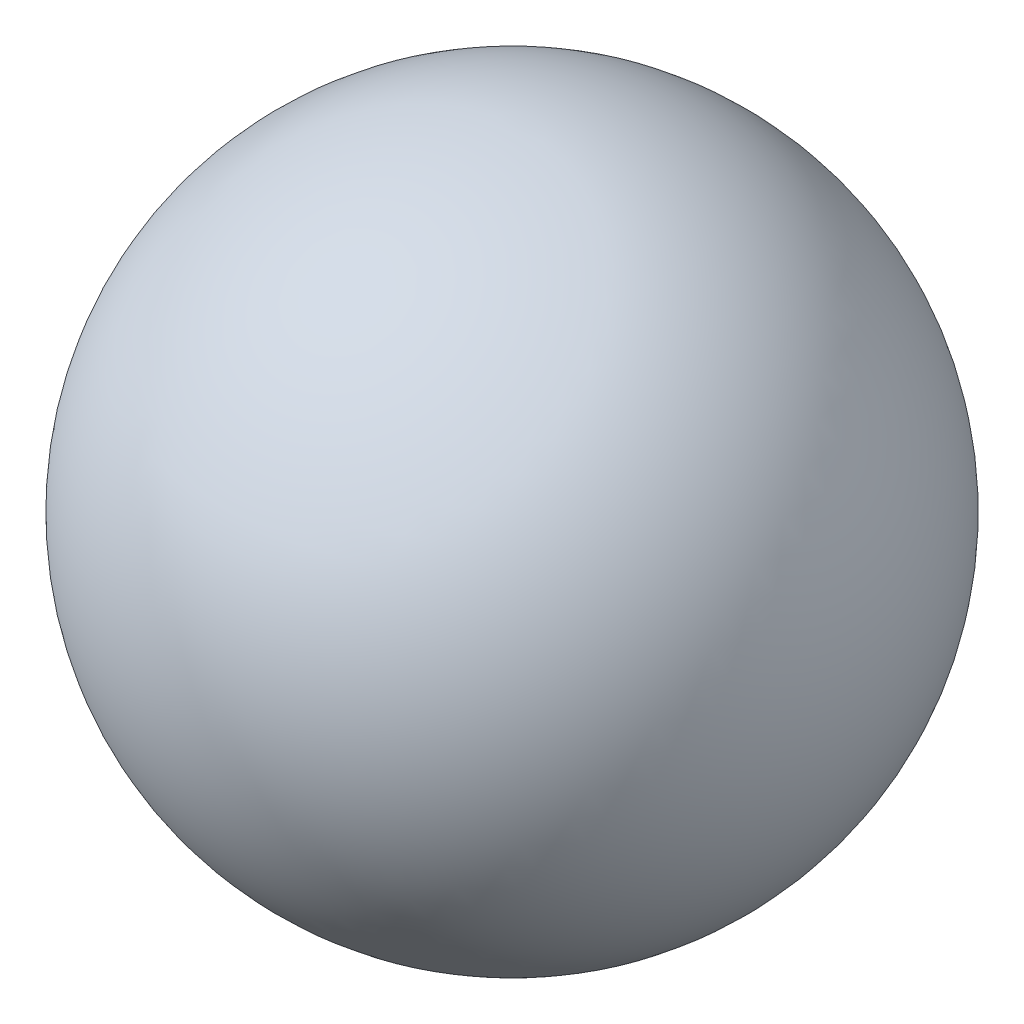
ISO-10303-21;
HEADER;
FILE_DESCRIPTION(('STEP AP214'),'2;1');
FILE_NAME('part.step','',(''),(''),'','','');
FILE_SCHEMA(('AUTOMOTIVE_DESIGN { 1 0 10303 214 1 1 1 1 }'));
ENDSEC;
DATA;
#1=APPLICATION_CONTEXT('core data for automotive mechanical design processes');
#2=APPLICATION_PROTOCOL_DEFINITION('international standard','automotive_design',2000,#1);
#3=PRODUCT_CONTEXT('',#1,'mechanical');
#4=PRODUCT('Part','Part','',(#3));
#5=PRODUCT_RELATED_PRODUCT_CATEGORY('part','',(#4));
#6=PRODUCT_DEFINITION_FORMATION('','',#4);
#7=PRODUCT_DEFINITION_CONTEXT('part definition',#1,'design');
#8=PRODUCT_DEFINITION('design','',#6,#7);
#9=PRODUCT_DEFINITION_SHAPE('','',#8);
#10=(LENGTH_UNIT() NAMED_UNIT(*) SI_UNIT(.MILLI.,.METRE.));
#11=(NAMED_UNIT(*) PLANE_ANGLE_UNIT() SI_UNIT($,.RADIAN.));
#12=(NAMED_UNIT(*) SI_UNIT($,.STERADIAN.) SOLID_ANGLE_UNIT());
#13=UNCERTAINTY_MEASURE_WITH_UNIT(LENGTH_MEASURE(1.E-05),#10,'distance_accuracy_value','');
#14=(GEOMETRIC_REPRESENTATION_CONTEXT(3) GLOBAL_UNCERTAINTY_ASSIGNED_CONTEXT((#13)) GLOBAL_UNIT_ASSIGNED_CONTEXT((#10,
#11,#12)) REPRESENTATION_CONTEXT('',''));
#15=CARTESIAN_POINT('',(0.,0.,0.));
#16=DIRECTION('',(0.,0.,1.));
#17=DIRECTION('',(1.,0.,0.));
#18=AXIS2_PLACEMENT_3D('',#15,#16,#17);
#19=CARTESIAN_POINT('',(0.,0.,0.));
#20=DIRECTION('',(0.,1.,0.));
#21=DIRECTION('',(1.,0.,0.));
#22=AXIS2_PLACEMENT_3D('',#19,#20,#21);
#23=SPHERICAL_SURFACE('',#22,0.24);
#24=CARTESIAN_POINT('',(0.,0.24,0.));
#25=VERTEX_POINT('',#24);
#26=VERTEX_LOOP('',#25);
#27=FACE_BOUND('',#26,.T.);
#28=ADVANCED_FACE('F28',(#27),#23,.T.);
#29=CLOSED_SHELL('',(#28));
#30=MANIFOLD_SOLID_BREP('B2',#29);
#31=ADVANCED_BREP_SHAPE_REPRESENTATION('',(#18,#30),#14);
#32=SHAPE_DEFINITION_REPRESENTATION(#9,#31);
ENDSEC;
END-ISO-10303-21;
